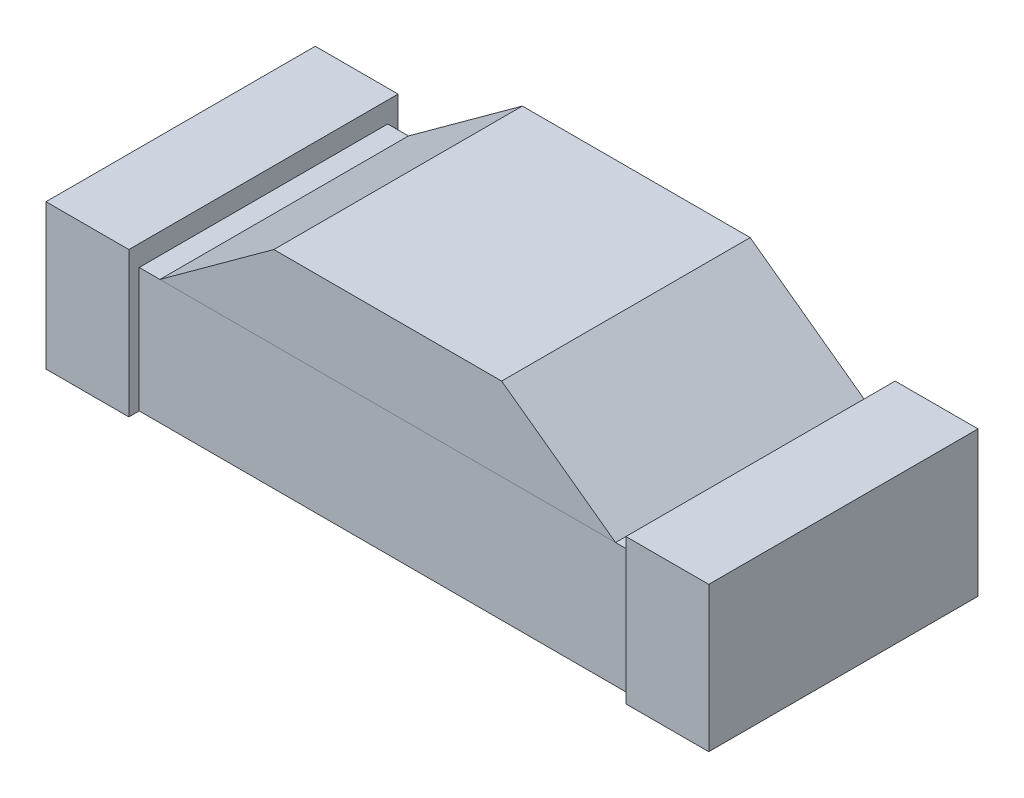
ISO-10303-21;
HEADER;
FILE_DESCRIPTION(('STEP AP214'),'2;1');
FILE_NAME('part.step','',(''),(''),'','','');
FILE_SCHEMA(('AUTOMOTIVE_DESIGN { 1 0 10303 214 1 1 1 1 }'));
ENDSEC;
DATA;
#1=APPLICATION_CONTEXT('core data for automotive mechanical design processes');
#2=APPLICATION_PROTOCOL_DEFINITION('international standard','automotive_design',2000,#1);
#3=PRODUCT_CONTEXT('',#1,'mechanical');
#4=PRODUCT('Part','Part','',(#3));
#5=PRODUCT_RELATED_PRODUCT_CATEGORY('part','',(#4));
#6=PRODUCT_DEFINITION_FORMATION('','',#4);
#7=PRODUCT_DEFINITION_CONTEXT('part definition',#1,'design');
#8=PRODUCT_DEFINITION('design','',#6,#7);
#9=PRODUCT_DEFINITION_SHAPE('','',#8);
#10=(LENGTH_UNIT() NAMED_UNIT(*) SI_UNIT(.MILLI.,.METRE.));
#11=(NAMED_UNIT(*) PLANE_ANGLE_UNIT() SI_UNIT($,.RADIAN.));
#12=(NAMED_UNIT(*) SI_UNIT($,.STERADIAN.) SOLID_ANGLE_UNIT());
#13=UNCERTAINTY_MEASURE_WITH_UNIT(LENGTH_MEASURE(1.E-05),#10,'distance_accuracy_value','');
#14=(GEOMETRIC_REPRESENTATION_CONTEXT(3) GLOBAL_UNCERTAINTY_ASSIGNED_CONTEXT((#13)) GLOBAL_UNIT_ASSIGNED_CONTEXT((#10,
#11,#12)) REPRESENTATION_CONTEXT('',''));
#15=CARTESIAN_POINT('',(0.,0.,0.));
#16=DIRECTION('',(0.,0.,1.));
#17=DIRECTION('',(1.,0.,0.));
#18=AXIS2_PLACEMENT_3D('',#15,#16,#17);
#19=CARTESIAN_POINT('',(-0.275,0.5,0.3));
#20=DIRECTION('',(0.588171697675046,-0.808736084303188,0.));
#21=DIRECTION('',(0.808736084303188,0.588171697675046,0.));
#22=AXIS2_PLACEMENT_3D('',#19,#20,#21);
#23=PLANE('',#22);
#24=DIRECTION('',(-0.808736084303188,-0.588171697675046,0.));
#25=VECTOR('',#24,1.);
#26=CARTESIAN_POINT('',(-0.275,0.5,-0.3));
#27=LINE('',#26,#25);
#28=CARTESIAN_POINT('',(-0.275,0.5,-0.3));
#29=VERTEX_POINT('',#28);
#30=CARTESIAN_POINT('',(-0.55,0.3,-0.3));
#31=VERTEX_POINT('',#30);
#32=EDGE_CURVE('E108',#29,#31,#27,.T.);
#33=ORIENTED_EDGE('',*,*,#32,.T.);
#34=DIRECTION('',(0.,0.,-1.));
#35=VECTOR('',#34,1.);
#36=CARTESIAN_POINT('',(-0.55,0.3,0.3));
#37=LINE('',#36,#35);
#38=CARTESIAN_POINT('',(-0.55,0.3,0.3));
#39=VERTEX_POINT('',#38);
#40=EDGE_CURVE('E12',#39,#31,#37,.T.);
#41=ORIENTED_EDGE('',*,*,#40,.F.);
#42=DIRECTION('',(-0.808736084303188,-0.588171697675046,0.));
#43=VECTOR('',#42,1.);
#44=CARTESIAN_POINT('',(-0.275,0.5,0.3));
#45=LINE('',#44,#43);
#46=CARTESIAN_POINT('',(-0.275,0.5,0.3));
#47=VERTEX_POINT('',#46);
#48=EDGE_CURVE('E96',#47,#39,#45,.T.);
#49=ORIENTED_EDGE('',*,*,#48,.F.);
#50=DIRECTION('',(0.,0.,-1.));
#51=VECTOR('',#50,1.);
#52=CARTESIAN_POINT('',(-0.275,0.5,0.3));
#53=LINE('',#52,#51);
#54=EDGE_CURVE('E104',#47,#29,#53,.T.);
#55=ORIENTED_EDGE('',*,*,#54,.T.);
#56=EDGE_LOOP('',(#33,#41,#49,#55));
#57=FACE_BOUND('',#56,.T.);
#58=ADVANCED_FACE('F45',(#57),#23,.F.);
#59=CARTESIAN_POINT('',(-0.55,0.3,0.3));
#60=DIRECTION('',(0.,1.,0.));
#61=DIRECTION('',(-1.,0.,0.));
#62=AXIS2_PLACEMENT_3D('',#59,#60,#61);
#63=PLANE('',#62);
#64=DIRECTION('',(1.,0.,0.));
#65=VECTOR('',#64,1.);
#66=CARTESIAN_POINT('',(-0.55,0.3,-0.3));
#67=LINE('',#66,#65);
#68=CARTESIAN_POINT('',(0.55,0.3,-0.3));
#69=VERTEX_POINT('',#68);
#70=EDGE_CURVE('E100',#31,#69,#67,.T.);
#71=ORIENTED_EDGE('',*,*,#70,.T.);
#72=DIRECTION('',(0.,0.,-1.));
#73=VECTOR('',#72,1.);
#74=CARTESIAN_POINT('',(0.55,0.3,0.3));
#75=LINE('',#74,#73);
#76=CARTESIAN_POINT('',(0.55,0.3,0.3));
#77=VERTEX_POINT('',#76);
#78=EDGE_CURVE('E53',#77,#69,#75,.T.);
#79=ORIENTED_EDGE('',*,*,#78,.F.);
#80=DIRECTION('',(1.,0.,0.));
#81=VECTOR('',#80,1.);
#82=CARTESIAN_POINT('',(-0.55,0.3,0.3));
#83=LINE('',#82,#81);
#84=EDGE_CURVE('E91',#39,#77,#83,.T.);
#85=ORIENTED_EDGE('',*,*,#84,.F.);
#86=ORIENTED_EDGE('',*,*,#40,.T.);
#87=EDGE_LOOP('',(#71,#79,#85,#86));
#88=FACE_BOUND('',#87,.T.);
#89=ADVANCED_FACE('F99',(#88),#63,.F.);
#90=CARTESIAN_POINT('',(0.55,0.3,0.3));
#91=DIRECTION('',(-0.588171697675047,-0.808736084303188,0.));
#92=DIRECTION('',(0.808736084303188,-0.588171697675047,0.));
#93=AXIS2_PLACEMENT_3D('',#90,#91,#92);
#94=PLANE('',#93);
#95=DIRECTION('',(-0.808736084303188,0.588171697675047,0.));
#96=VECTOR('',#95,1.);
#97=CARTESIAN_POINT('',(0.55,0.3,-0.3));
#98=LINE('',#97,#96);
#99=CARTESIAN_POINT('',(0.275,0.5,-0.3));
#100=VERTEX_POINT('',#99);
#101=EDGE_CURVE('E78',#69,#100,#98,.T.);
#102=ORIENTED_EDGE('',*,*,#101,.T.);
#103=DIRECTION('',(0.,0.,-1.));
#104=VECTOR('',#103,1.);
#105=CARTESIAN_POINT('',(0.275,0.5,0.3));
#106=LINE('',#105,#104);
#107=CARTESIAN_POINT('',(0.275,0.5,0.3));
#108=VERTEX_POINT('',#107);
#109=EDGE_CURVE('E101',#108,#100,#106,.T.);
#110=ORIENTED_EDGE('',*,*,#109,.F.);
#111=DIRECTION('',(-0.808736084303188,0.588171697675047,0.));
#112=VECTOR('',#111,1.);
#113=CARTESIAN_POINT('',(0.55,0.3,0.3));
#114=LINE('',#113,#112);
#115=EDGE_CURVE('E94',#77,#108,#114,.T.);
#116=ORIENTED_EDGE('',*,*,#115,.F.);
#117=ORIENTED_EDGE('',*,*,#78,.T.);
#118=EDGE_LOOP('',(#102,#110,#116,#117));
#119=FACE_BOUND('',#118,.T.);
#120=ADVANCED_FACE('F102',(#119),#94,.F.);
#121=CARTESIAN_POINT('',(0.275,0.5,0.3));
#122=DIRECTION('',(0.,-1.,0.));
#123=DIRECTION('',(1.,0.,0.));
#124=AXIS2_PLACEMENT_3D('',#121,#122,#123);
#125=PLANE('',#124);
#126=DIRECTION('',(-1.,0.,0.));
#127=VECTOR('',#126,1.);
#128=CARTESIAN_POINT('',(0.275,0.5,-0.3));
#129=LINE('',#128,#127);
#130=EDGE_CURVE('E84',#100,#29,#129,.T.);
#131=ORIENTED_EDGE('',*,*,#130,.T.);
#132=ORIENTED_EDGE('',*,*,#54,.F.);
#133=DIRECTION('',(-1.,0.,0.));
#134=VECTOR('',#133,1.);
#135=CARTESIAN_POINT('',(0.275,0.5,0.3));
#136=LINE('',#135,#134);
#137=EDGE_CURVE('E61',#108,#47,#136,.T.);
#138=ORIENTED_EDGE('',*,*,#137,.F.);
#139=ORIENTED_EDGE('',*,*,#109,.T.);
#140=EDGE_LOOP('',(#131,#132,#138,#139));
#141=FACE_BOUND('',#140,.T.);
#142=ADVANCED_FACE('F115',(#141),#125,.F.);
#143=CARTESIAN_POINT('',(0.,0.,0.3));
#144=DIRECTION('',(0.,0.,-1.));
#145=DIRECTION('',(-1.,0.,0.));
#146=AXIS2_PLACEMENT_3D('',#143,#144,#145);
#147=PLANE('',#146);
#148=ORIENTED_EDGE('',*,*,#48,.T.);
#149=ORIENTED_EDGE('',*,*,#84,.T.);
#150=ORIENTED_EDGE('',*,*,#115,.T.);
#151=ORIENTED_EDGE('',*,*,#137,.T.);
#152=EDGE_LOOP('',(#148,#149,#150,#151));
#153=FACE_BOUND('',#152,.T.);
#154=ADVANCED_FACE('F92',(#153),#147,.F.);
#155=CARTESIAN_POINT('',(0.,0.,-0.3));
#156=DIRECTION('',(0.,0.,-1.));
#157=DIRECTION('',(-1.,0.,0.));
#158=AXIS2_PLACEMENT_3D('',#155,#156,#157);
#159=PLANE('',#158);
#160=ORIENTED_EDGE('',*,*,#32,.F.);
#161=ORIENTED_EDGE('',*,*,#130,.F.);
#162=ORIENTED_EDGE('',*,*,#101,.F.);
#163=ORIENTED_EDGE('',*,*,#70,.F.);
#164=EDGE_LOOP('',(#160,#161,#162,#163));
#165=FACE_BOUND('',#164,.T.);
#166=ADVANCED_FACE('F118',(#165),#159,.T.);
#167=CLOSED_SHELL('',(#58,#89,#120,#142,#154,#166));
#168=MANIFOLD_SOLID_BREP('B2',#167);
#169=CARTESIAN_POINT('',(-0.750000000000001,0.3,0.));
#170=DIRECTION('',(0.,1.,0.));
#171=DIRECTION('',(0.,0.,1.));
#172=AXIS2_PLACEMENT_3D('',#169,#170,#171);
#173=PLANE('',#172);
#174=DIRECTION('',(0.,0.,1.));
#175=VECTOR('',#174,1.);
#176=CARTESIAN_POINT('',(0.6,0.3,0.));
#177=LINE('',#176,#175);
#178=CARTESIAN_POINT('',(0.6,0.3,-0.3));
#179=VERTEX_POINT('',#178);
#180=CARTESIAN_POINT('',(0.6,0.3,0.3));
#181=VERTEX_POINT('',#180);
#182=EDGE_CURVE('E192',#179,#181,#177,.T.);
#183=ORIENTED_EDGE('',*,*,#182,.F.);
#184=DIRECTION('',(-1.,0.,0.));
#185=VECTOR('',#184,1.);
#186=CARTESIAN_POINT('',(-0.75,0.3,-0.3));
#187=LINE('',#186,#185);
#188=CARTESIAN_POINT('',(-0.6,0.3,-0.3));
#189=VERTEX_POINT('',#188);
#190=EDGE_CURVE('E43',#179,#189,#187,.T.);
#191=ORIENTED_EDGE('',*,*,#190,.T.);
#192=DIRECTION('',(0.,0.,1.));
#193=VECTOR('',#192,1.);
#194=CARTESIAN_POINT('',(-0.6,0.3,0.));
#195=LINE('',#194,#193);
#196=CARTESIAN_POINT('',(-0.6,0.3,0.3));
#197=VERTEX_POINT('',#196);
#198=EDGE_CURVE('E343',#189,#197,#195,.T.);
#199=ORIENTED_EDGE('',*,*,#198,.T.);
#200=DIRECTION('',(1.,0.,0.));
#201=VECTOR('',#200,1.);
#202=CARTESIAN_POINT('',(-0.75,0.3,0.3));
#203=LINE('',#202,#201);
#204=EDGE_CURVE('E178',#197,#181,#203,.T.);
#205=ORIENTED_EDGE('',*,*,#204,.T.);
#206=EDGE_LOOP('',(#183,#191,#199,#205));
#207=FACE_BOUND('',#206,.T.);
#208=CARTESIAN_POINT('',(0.,0.3,0.));
#209=DIRECTION('',(0.,1.,0.));
#210=DIRECTION('',(0.,0.,1.));
#211=AXIS2_PLACEMENT_3D('',#208,#209,#210);
#212=CIRCLE('',#211,0.2);
#213=CARTESIAN_POINT('',(0.,0.3,0.2));
#214=VERTEX_POINT('',#213);
#215=EDGE_CURVE('E351',#214,#214,#212,.T.);
#216=ORIENTED_EDGE('',*,*,#215,.F.);
#217=EDGE_LOOP('',(#216));
#218=FACE_BOUND('',#217,.T.);
#219=ADVANCED_FACE('F169',(#207,#218),#173,.T.);
#220=CARTESIAN_POINT('',(-0.75,0.3,0.3));
#221=DIRECTION('',(0.,0.,-1.));
#222=DIRECTION('',(-1.,0.,0.));
#223=AXIS2_PLACEMENT_3D('',#220,#221,#222);
#224=PLANE('',#223);
#225=DIRECTION('',(1.,0.,0.));
#226=VECTOR('',#225,1.);
#227=CARTESIAN_POINT('',(-0.75,0.,0.3));
#228=LINE('',#227,#226);
#229=CARTESIAN_POINT('',(-0.6,0.,0.3));
#230=VERTEX_POINT('',#229);
#231=CARTESIAN_POINT('',(0.6,0.,0.3));
#232=VERTEX_POINT('',#231);
#233=EDGE_CURVE('E354',#230,#232,#228,.T.);
#234=ORIENTED_EDGE('',*,*,#233,.T.);
#235=DIRECTION('',(0.,1.,0.));
#236=VECTOR('',#235,1.);
#237=CARTESIAN_POINT('',(0.6,0.3,0.3));
#238=LINE('',#237,#236);
#239=EDGE_CURVE('E186',#232,#181,#238,.T.);
#240=ORIENTED_EDGE('',*,*,#239,.T.);
#241=ORIENTED_EDGE('',*,*,#204,.F.);
#242=DIRECTION('',(0.,1.,0.));
#243=VECTOR('',#242,1.);
#244=CARTESIAN_POINT('',(-0.6,0.3,0.3));
#245=LINE('',#244,#243);
#246=EDGE_CURVE('E345',#230,#197,#245,.T.);
#247=ORIENTED_EDGE('',*,*,#246,.F.);
#248=EDGE_LOOP('',(#234,#240,#241,#247));
#249=FACE_BOUND('',#248,.T.);
#250=ADVANCED_FACE('F171',(#249),#224,.F.);
#251=CARTESIAN_POINT('',(-0.75,0.3,-0.3));
#252=DIRECTION('',(0.,0.,1.));
#253=DIRECTION('',(1.,0.,0.));
#254=AXIS2_PLACEMENT_3D('',#251,#252,#253);
#255=PLANE('',#254);
#256=ORIENTED_EDGE('',*,*,#190,.F.);
#257=DIRECTION('',(0.,-1.,0.));
#258=VECTOR('',#257,1.);
#259=CARTESIAN_POINT('',(0.6,0.3,-0.3));
#260=LINE('',#259,#258);
#261=CARTESIAN_POINT('',(0.6,0.,-0.3));
#262=VERTEX_POINT('',#261);
#263=EDGE_CURVE('E271',#179,#262,#260,.T.);
#264=ORIENTED_EDGE('',*,*,#263,.T.);
#265=DIRECTION('',(-1.,0.,0.));
#266=VECTOR('',#265,1.);
#267=CARTESIAN_POINT('',(-0.75,0.,-0.3));
#268=LINE('',#267,#266);
#269=CARTESIAN_POINT('',(-0.6,0.,-0.3));
#270=VERTEX_POINT('',#269);
#271=EDGE_CURVE('E173',#262,#270,#268,.T.);
#272=ORIENTED_EDGE('',*,*,#271,.T.);
#273=DIRECTION('',(0.,-1.,0.));
#274=VECTOR('',#273,1.);
#275=CARTESIAN_POINT('',(-0.6,0.3,-0.3));
#276=LINE('',#275,#274);
#277=EDGE_CURVE('E340',#189,#270,#276,.T.);
#278=ORIENTED_EDGE('',*,*,#277,.F.);
#279=EDGE_LOOP('',(#256,#264,#272,#278));
#280=FACE_BOUND('',#279,.T.);
#281=ADVANCED_FACE('F359',(#280),#255,.F.);
#282=CARTESIAN_POINT('',(-0.750000000000001,0.,0.));
#283=DIRECTION('',(0.,1.,0.));
#284=DIRECTION('',(0.,0.,1.));
#285=AXIS2_PLACEMENT_3D('',#282,#283,#284);
#286=PLANE('',#285);
#287=ORIENTED_EDGE('',*,*,#271,.F.);
#288=DIRECTION('',(0.,0.,-1.));
#289=VECTOR('',#288,1.);
#290=CARTESIAN_POINT('',(0.6,0.,-0.325));
#291=LINE('',#290,#289);
#292=CARTESIAN_POINT('',(0.6,0.,-0.325));
#293=VERTEX_POINT('',#292);
#294=EDGE_CURVE('E295',#262,#293,#291,.T.);
#295=ORIENTED_EDGE('',*,*,#294,.T.);
#296=DIRECTION('',(1.,0.,0.));
#297=VECTOR('',#296,1.);
#298=CARTESIAN_POINT('',(0.8,0.,-0.325));
#299=LINE('',#298,#297);
#300=CARTESIAN_POINT('',(0.8,0.,-0.325));
#301=VERTEX_POINT('',#300);
#302=EDGE_CURVE('E293',#293,#301,#299,.T.);
#303=ORIENTED_EDGE('',*,*,#302,.T.);
#304=DIRECTION('',(0.,0.,1.));
#305=VECTOR('',#304,1.);
#306=CARTESIAN_POINT('',(0.8,0.,-0.325));
#307=LINE('',#306,#305);
#308=CARTESIAN_POINT('',(0.800000000000001,0.,0.325));
#309=VERTEX_POINT('',#308);
#310=EDGE_CURVE('E266',#301,#309,#307,.T.);
#311=ORIENTED_EDGE('',*,*,#310,.T.);
#312=DIRECTION('',(-1.,0.,0.));
#313=VECTOR('',#312,1.);
#314=CARTESIAN_POINT('',(0.800000000000001,0.,0.325));
#315=LINE('',#314,#313);
#316=CARTESIAN_POINT('',(0.6,0.,0.325));
#317=VERTEX_POINT('',#316);
#318=EDGE_CURVE('E282',#309,#317,#315,.T.);
#319=ORIENTED_EDGE('',*,*,#318,.T.);
#320=EDGE_CURVE('E296',#317,#232,#291,.T.);
#321=ORIENTED_EDGE('',*,*,#320,.T.);
#322=ORIENTED_EDGE('',*,*,#233,.F.);
#323=DIRECTION('',(0.,0.,-1.));
#324=VECTOR('',#323,1.);
#325=CARTESIAN_POINT('',(-0.6,0.,-0.325));
#326=LINE('',#325,#324);
#327=CARTESIAN_POINT('',(-0.6,0.,0.325));
#328=VERTEX_POINT('',#327);
#329=EDGE_CURVE('E325',#328,#230,#326,.T.);
#330=ORIENTED_EDGE('',*,*,#329,.F.);
#331=DIRECTION('',(1.,0.,0.));
#332=VECTOR('',#331,1.);
#333=CARTESIAN_POINT('',(-0.800000000000001,0.,0.325));
#334=LINE('',#333,#332);
#335=CARTESIAN_POINT('',(-0.800000000000001,0.,0.325));
#336=VERTEX_POINT('',#335);
#337=EDGE_CURVE('E322',#336,#328,#334,.T.);
#338=ORIENTED_EDGE('',*,*,#337,.F.);
#339=DIRECTION('',(0.,0.,1.));
#340=VECTOR('',#339,1.);
#341=CARTESIAN_POINT('',(-0.8,0.,-0.325));
#342=LINE('',#341,#340);
#343=CARTESIAN_POINT('',(-0.8,0.,-0.325));
#344=VERTEX_POINT('',#343);
#345=EDGE_CURVE('E308',#344,#336,#342,.T.);
#346=ORIENTED_EDGE('',*,*,#345,.F.);
#347=DIRECTION('',(-1.,0.,0.));
#348=VECTOR('',#347,1.);
#349=CARTESIAN_POINT('',(-0.8,0.,-0.325));
#350=LINE('',#349,#348);
#351=CARTESIAN_POINT('',(-0.6,0.,-0.325));
#352=VERTEX_POINT('',#351);
#353=EDGE_CURVE('E313',#352,#344,#350,.T.);
#354=ORIENTED_EDGE('',*,*,#353,.F.);
#355=EDGE_CURVE('E324',#270,#352,#326,.T.);
#356=ORIENTED_EDGE('',*,*,#355,.F.);
#357=EDGE_LOOP('',(#287,#295,#303,#311,#319,#321,#322,#330,#338,#346,#354,#356));
#358=FACE_BOUND('',#357,.T.);
#359=ADVANCED_FACE('F369',(#358),#286,.F.);
#360=CARTESIAN_POINT('',(0.,0.809216281577376,0.));
#361=DIRECTION('',(0.,1.,0.));
#362=DIRECTION('',(0.,0.,1.));
#363=AXIS2_PLACEMENT_3D('',#360,#361,#362);
#364=CYLINDRICAL_SURFACE('',#363,0.2);
#365=CARTESIAN_POINT('',(0.,0.4,0.));
#366=DIRECTION('',(0.,1.,0.));
#367=DIRECTION('',(0.,0.,1.));
#368=AXIS2_PLACEMENT_3D('',#365,#366,#367);
#369=CIRCLE('',#368,0.2);
#370=CARTESIAN_POINT('',(0.,0.4,0.2));
#371=VERTEX_POINT('',#370);
#372=EDGE_CURVE('E348',#371,#371,#369,.T.);
#373=ORIENTED_EDGE('',*,*,#372,.F.);
#374=EDGE_LOOP('',(#373));
#375=FACE_BOUND('',#374,.T.);
#376=ORIENTED_EDGE('',*,*,#215,.T.);
#377=EDGE_LOOP('',(#376));
#378=FACE_BOUND('',#377,.T.);
#379=ADVANCED_FACE('F408',(#375,#378),#364,.T.);
#380=CARTESIAN_POINT('',(0.,0.4,0.));
#381=DIRECTION('',(0.,-1.,0.));
#382=DIRECTION('',(0.,0.,-1.));
#383=AXIS2_PLACEMENT_3D('',#380,#381,#382);
#384=PLANE('',#383);
#385=ORIENTED_EDGE('',*,*,#372,.T.);
#386=EDGE_LOOP('',(#385));
#387=FACE_BOUND('',#386,.T.);
#388=ADVANCED_FACE('F427',(#387),#384,.F.);
#389=CARTESIAN_POINT('',(-0.6,0.35,-0.325));
#390=DIRECTION('',(-1.,0.,0.));
#391=DIRECTION('',(0.,0.,1.));
#392=AXIS2_PLACEMENT_3D('',#389,#390,#391);
#393=PLANE('',#392);
#394=ORIENTED_EDGE('',*,*,#329,.T.);
#395=ORIENTED_EDGE('',*,*,#246,.T.);
#396=ORIENTED_EDGE('',*,*,#198,.F.);
#397=ORIENTED_EDGE('',*,*,#277,.T.);
#398=ORIENTED_EDGE('',*,*,#355,.T.);
#399=DIRECTION('',(0.,-1.,0.));
#400=VECTOR('',#399,1.);
#401=CARTESIAN_POINT('',(-0.6,0.35,-0.325));
#402=LINE('',#401,#400);
#403=CARTESIAN_POINT('',(-0.6,0.35,-0.325));
#404=VERTEX_POINT('',#403);
#405=EDGE_CURVE('E331',#404,#352,#402,.T.);
#406=ORIENTED_EDGE('',*,*,#405,.F.);
#407=DIRECTION('',(0.,0.,-1.));
#408=VECTOR('',#407,1.);
#409=CARTESIAN_POINT('',(-0.6,0.35,-0.325));
#410=LINE('',#409,#408);
#411=CARTESIAN_POINT('',(-0.6,0.35,0.325));
#412=VERTEX_POINT('',#411);
#413=EDGE_CURVE('E315',#412,#404,#410,.T.);
#414=ORIENTED_EDGE('',*,*,#413,.F.);
#415=DIRECTION('',(0.,-1.,0.));
#416=VECTOR('',#415,1.);
#417=CARTESIAN_POINT('',(-0.6,0.35,0.325));
#418=LINE('',#417,#416);
#419=EDGE_CURVE('E334',#412,#328,#418,.T.);
#420=ORIENTED_EDGE('',*,*,#419,.T.);
#421=EDGE_LOOP('',(#394,#395,#396,#397,#398,#406,#414,#420));
#422=FACE_BOUND('',#421,.T.);
#423=ADVANCED_FACE('F366',(#422),#393,.F.);
#424=CARTESIAN_POINT('',(-0.8,0.35,-0.325));
#425=DIRECTION('',(1.,0.,0.));
#426=DIRECTION('',(0.,0.,-1.));
#427=AXIS2_PLACEMENT_3D('',#424,#425,#426);
#428=PLANE('',#427);
#429=ORIENTED_EDGE('',*,*,#345,.T.);
#430=DIRECTION('',(0.,-1.,0.));
#431=VECTOR('',#430,1.);
#432=CARTESIAN_POINT('',(-0.800000000000001,0.35,0.325));
#433=LINE('',#432,#431);
#434=CARTESIAN_POINT('',(-0.800000000000001,0.35,0.325));
#435=VERTEX_POINT('',#434);
#436=EDGE_CURVE('E337',#435,#336,#433,.T.);
#437=ORIENTED_EDGE('',*,*,#436,.F.);
#438=DIRECTION('',(0.,0.,1.));
#439=VECTOR('',#438,1.);
#440=CARTESIAN_POINT('',(-0.8,0.35,-0.325));
#441=LINE('',#440,#439);
#442=CARTESIAN_POINT('',(-0.8,0.35,-0.325));
#443=VERTEX_POINT('',#442);
#444=EDGE_CURVE('E309',#443,#435,#441,.T.);
#445=ORIENTED_EDGE('',*,*,#444,.F.);
#446=DIRECTION('',(0.,-1.,0.));
#447=VECTOR('',#446,1.);
#448=CARTESIAN_POINT('',(-0.8,0.35,-0.325));
#449=LINE('',#448,#447);
#450=EDGE_CURVE('E319',#443,#344,#449,.T.);
#451=ORIENTED_EDGE('',*,*,#450,.T.);
#452=EDGE_LOOP('',(#429,#437,#445,#451));
#453=FACE_BOUND('',#452,.T.);
#454=ADVANCED_FACE('F377',(#453),#428,.F.);
#455=CARTESIAN_POINT('',(-0.800000000000001,0.35,0.325));
#456=DIRECTION('',(0.,0.,-1.));
#457=DIRECTION('',(-1.,0.,0.));
#458=AXIS2_PLACEMENT_3D('',#455,#456,#457);
#459=PLANE('',#458);
#460=ORIENTED_EDGE('',*,*,#337,.T.);
#461=ORIENTED_EDGE('',*,*,#419,.F.);
#462=DIRECTION('',(1.,0.,0.));
#463=VECTOR('',#462,1.);
#464=CARTESIAN_POINT('',(-0.800000000000001,0.35,0.325));
#465=LINE('',#464,#463);
#466=EDGE_CURVE('E312',#435,#412,#465,.T.);
#467=ORIENTED_EDGE('',*,*,#466,.F.);
#468=ORIENTED_EDGE('',*,*,#436,.T.);
#469=EDGE_LOOP('',(#460,#461,#467,#468));
#470=FACE_BOUND('',#469,.T.);
#471=ADVANCED_FACE('F446',(#470),#459,.F.);
#472=CARTESIAN_POINT('',(-0.8,0.35,-0.325));
#473=DIRECTION('',(0.,0.,1.));
#474=DIRECTION('',(1.,0.,0.));
#475=AXIS2_PLACEMENT_3D('',#472,#473,#474);
#476=PLANE('',#475);
#477=ORIENTED_EDGE('',*,*,#353,.T.);
#478=ORIENTED_EDGE('',*,*,#450,.F.);
#479=DIRECTION('',(-1.,0.,0.));
#480=VECTOR('',#479,1.);
#481=CARTESIAN_POINT('',(-0.8,0.35,-0.325));
#482=LINE('',#481,#480);
#483=EDGE_CURVE('E317',#404,#443,#482,.T.);
#484=ORIENTED_EDGE('',*,*,#483,.F.);
#485=ORIENTED_EDGE('',*,*,#405,.T.);
#486=EDGE_LOOP('',(#477,#478,#484,#485));
#487=FACE_BOUND('',#486,.T.);
#488=ADVANCED_FACE('F373',(#487),#476,.F.);
#489=CARTESIAN_POINT('',(0.,0.35,0.));
#490=DIRECTION('',(0.,1.,0.));
#491=DIRECTION('',(0.,0.,1.));
#492=AXIS2_PLACEMENT_3D('',#489,#490,#491);
#493=PLANE('',#492);
#494=ORIENTED_EDGE('',*,*,#444,.T.);
#495=ORIENTED_EDGE('',*,*,#466,.T.);
#496=ORIENTED_EDGE('',*,*,#413,.T.);
#497=ORIENTED_EDGE('',*,*,#483,.T.);
#498=EDGE_LOOP('',(#494,#495,#496,#497));
#499=FACE_BOUND('',#498,.T.);
#500=ADVANCED_FACE('F380',(#499),#493,.T.);
#501=CARTESIAN_POINT('',(0.6,0.35,-0.325));
#502=DIRECTION('',(-1.,0.,0.));
#503=DIRECTION('',(0.,0.,1.));
#504=AXIS2_PLACEMENT_3D('',#501,#502,#503);
#505=PLANE('',#504);
#506=ORIENTED_EDGE('',*,*,#239,.F.);
#507=ORIENTED_EDGE('',*,*,#320,.F.);
#508=DIRECTION('',(0.,-1.,0.));
#509=VECTOR('',#508,1.);
#510=CARTESIAN_POINT('',(0.6,0.35,0.325));
#511=LINE('',#510,#509);
#512=CARTESIAN_POINT('',(0.6,0.35,0.325));
#513=VERTEX_POINT('',#512);
#514=EDGE_CURVE('E302',#513,#317,#511,.T.);
#515=ORIENTED_EDGE('',*,*,#514,.F.);
#516=DIRECTION('',(0.,0.,-1.));
#517=VECTOR('',#516,1.);
#518=CARTESIAN_POINT('',(0.6,0.35,-0.325));
#519=LINE('',#518,#517);
#520=CARTESIAN_POINT('',(0.6,0.35,-0.325));
#521=VERTEX_POINT('',#520);
#522=EDGE_CURVE('E286',#513,#521,#519,.T.);
#523=ORIENTED_EDGE('',*,*,#522,.T.);
#524=DIRECTION('',(0.,-1.,0.));
#525=VECTOR('',#524,1.);
#526=CARTESIAN_POINT('',(0.6,0.35,-0.325));
#527=LINE('',#526,#525);
#528=EDGE_CURVE('E272',#521,#293,#527,.T.);
#529=ORIENTED_EDGE('',*,*,#528,.T.);
#530=ORIENTED_EDGE('',*,*,#294,.F.);
#531=ORIENTED_EDGE('',*,*,#263,.F.);
#532=ORIENTED_EDGE('',*,*,#182,.T.);
#533=EDGE_LOOP('',(#506,#507,#515,#523,#529,#530,#531,#532));
#534=FACE_BOUND('',#533,.T.);
#535=ADVANCED_FACE('F388',(#534),#505,.T.);
#536=CARTESIAN_POINT('',(0.8,0.35,-0.325));
#537=DIRECTION('',(1.,0.,0.));
#538=DIRECTION('',(0.,0.,-1.));
#539=AXIS2_PLACEMENT_3D('',#536,#537,#538);
#540=PLANE('',#539);
#541=ORIENTED_EDGE('',*,*,#310,.F.);
#542=DIRECTION('',(0.,-1.,0.));
#543=VECTOR('',#542,1.);
#544=CARTESIAN_POINT('',(0.8,0.35,-0.325));
#545=LINE('',#544,#543);
#546=CARTESIAN_POINT('',(0.8,0.35,-0.325));
#547=VERTEX_POINT('',#546);
#548=EDGE_CURVE('E260',#547,#301,#545,.T.);
#549=ORIENTED_EDGE('',*,*,#548,.F.);
#550=DIRECTION('',(0.,0.,1.));
#551=VECTOR('',#550,1.);
#552=CARTESIAN_POINT('',(0.8,0.35,-0.325));
#553=LINE('',#552,#551);
#554=CARTESIAN_POINT('',(0.800000000000001,0.35,0.325));
#555=VERTEX_POINT('',#554);
#556=EDGE_CURVE('E263',#547,#555,#553,.T.);
#557=ORIENTED_EDGE('',*,*,#556,.T.);
#558=DIRECTION('',(0.,-1.,0.));
#559=VECTOR('',#558,1.);
#560=CARTESIAN_POINT('',(0.800000000000001,0.35,0.325));
#561=LINE('',#560,#559);
#562=EDGE_CURVE('E291',#555,#309,#561,.T.);
#563=ORIENTED_EDGE('',*,*,#562,.T.);
#564=EDGE_LOOP('',(#541,#549,#557,#563));
#565=FACE_BOUND('',#564,.T.);
#566=ADVANCED_FACE('F262',(#565),#540,.T.);
#567=CARTESIAN_POINT('',(0.8,0.35,-0.325));
#568=DIRECTION('',(0.,0.,-1.));
#569=DIRECTION('',(-1.,0.,0.));
#570=AXIS2_PLACEMENT_3D('',#567,#568,#569);
#571=PLANE('',#570);
#572=ORIENTED_EDGE('',*,*,#302,.F.);
#573=ORIENTED_EDGE('',*,*,#528,.F.);
#574=DIRECTION('',(1.,0.,0.));
#575=VECTOR('',#574,1.);
#576=CARTESIAN_POINT('',(0.8,0.35,-0.325));
#577=LINE('',#576,#575);
#578=EDGE_CURVE('E278',#521,#547,#577,.T.);
#579=ORIENTED_EDGE('',*,*,#578,.T.);
#580=ORIENTED_EDGE('',*,*,#548,.T.);
#581=EDGE_LOOP('',(#572,#573,#579,#580));
#582=FACE_BOUND('',#581,.T.);
#583=ADVANCED_FACE('F284',(#582),#571,.T.);
#584=CARTESIAN_POINT('',(0.800000000000001,0.35,0.325));
#585=DIRECTION('',(0.,0.,1.));
#586=DIRECTION('',(1.,0.,0.));
#587=AXIS2_PLACEMENT_3D('',#584,#585,#586);
#588=PLANE('',#587);
#589=ORIENTED_EDGE('',*,*,#318,.F.);
#590=ORIENTED_EDGE('',*,*,#562,.F.);
#591=DIRECTION('',(-1.,0.,0.));
#592=VECTOR('',#591,1.);
#593=CARTESIAN_POINT('',(0.800000000000001,0.35,0.325));
#594=LINE('',#593,#592);
#595=EDGE_CURVE('E281',#555,#513,#594,.T.);
#596=ORIENTED_EDGE('',*,*,#595,.T.);
#597=ORIENTED_EDGE('',*,*,#514,.T.);
#598=EDGE_LOOP('',(#589,#590,#596,#597));
#599=FACE_BOUND('',#598,.T.);
#600=ADVANCED_FACE('F390',(#599),#588,.T.);
#601=CARTESIAN_POINT('',(0.,0.35,0.));
#602=DIRECTION('',(0.,1.,0.));
#603=DIRECTION('',(0.,0.,1.));
#604=AXIS2_PLACEMENT_3D('',#601,#602,#603);
#605=PLANE('',#604);
#606=ORIENTED_EDGE('',*,*,#556,.F.);
#607=ORIENTED_EDGE('',*,*,#578,.F.);
#608=ORIENTED_EDGE('',*,*,#522,.F.);
#609=ORIENTED_EDGE('',*,*,#595,.F.);
#610=EDGE_LOOP('',(#606,#607,#608,#609));
#611=FACE_BOUND('',#610,.T.);
#612=ADVANCED_FACE('F276',(#611),#605,.T.);
#613=CLOSED_SHELL('',(#219,#250,#281,#359,#379,#388,#423,#454,#471,#488,#500,#535,#566,#583,
#600,#612));
#614=MANIFOLD_SOLID_BREP('B6',#613);
#615=ADVANCED_BREP_SHAPE_REPRESENTATION('',(#18,#168,#614),#14);
#616=SHAPE_DEFINITION_REPRESENTATION(#9,#615);
ENDSEC;
END-ISO-10303-21;
